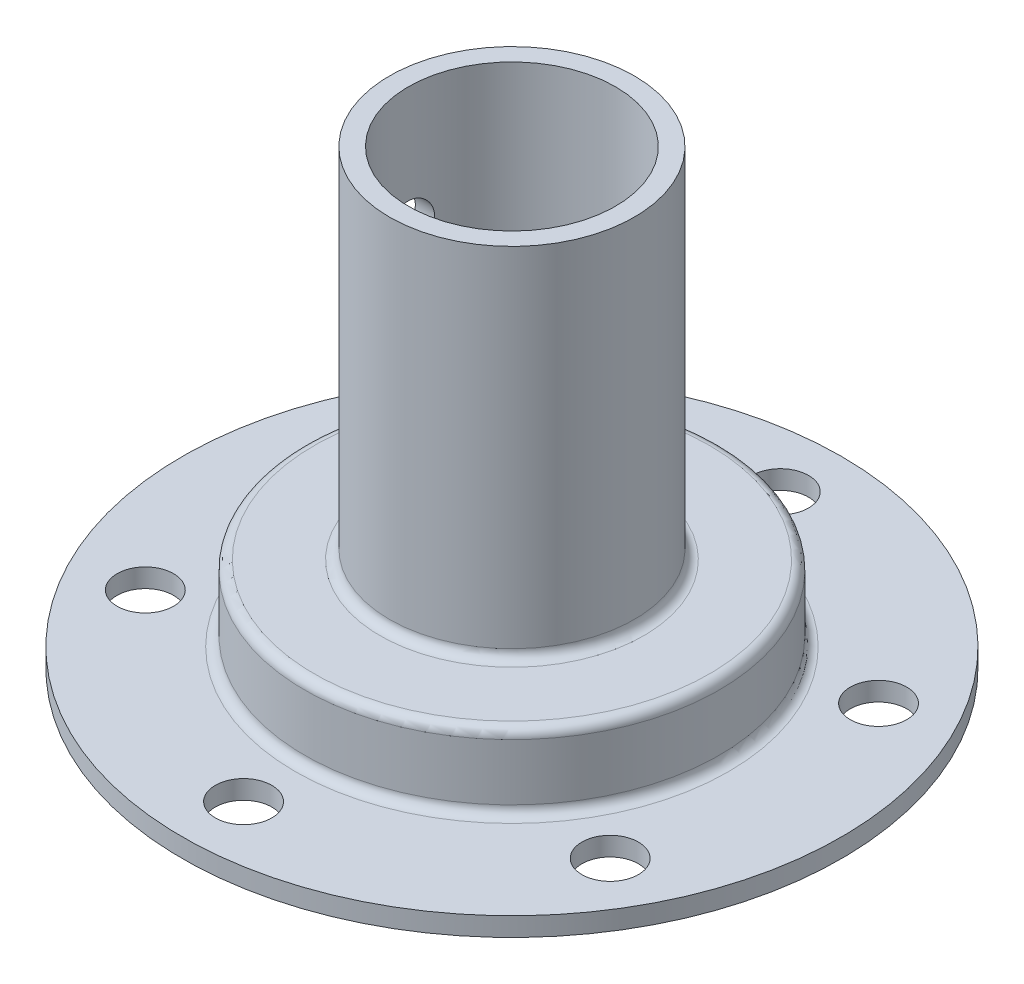
ISO-10303-21;
HEADER;
FILE_DESCRIPTION(('STEP AP214'),'2;1');
FILE_NAME('part.step','',(''),(''),'','','');
FILE_SCHEMA(('AUTOMOTIVE_DESIGN { 1 0 10303 214 1 1 1 1 }'));
ENDSEC;
DATA;
#1=APPLICATION_CONTEXT('core data for automotive mechanical design processes');
#2=APPLICATION_PROTOCOL_DEFINITION('international standard','automotive_design',2000,#1);
#3=PRODUCT_CONTEXT('',#1,'mechanical');
#4=PRODUCT('Part','Part','',(#3));
#5=PRODUCT_RELATED_PRODUCT_CATEGORY('part','',(#4));
#6=PRODUCT_DEFINITION_FORMATION('','',#4);
#7=PRODUCT_DEFINITION_CONTEXT('part definition',#1,'design');
#8=PRODUCT_DEFINITION('design','',#6,#7);
#9=PRODUCT_DEFINITION_SHAPE('','',#8);
#10=(LENGTH_UNIT() NAMED_UNIT(*) SI_UNIT(.MILLI.,.METRE.));
#11=(NAMED_UNIT(*) PLANE_ANGLE_UNIT() SI_UNIT($,.RADIAN.));
#12=(NAMED_UNIT(*) SI_UNIT($,.STERADIAN.) SOLID_ANGLE_UNIT());
#13=UNCERTAINTY_MEASURE_WITH_UNIT(LENGTH_MEASURE(1.E-05),#10,'distance_accuracy_value','');
#14=(GEOMETRIC_REPRESENTATION_CONTEXT(3) GLOBAL_UNCERTAINTY_ASSIGNED_CONTEXT((#13)) GLOBAL_UNIT_ASSIGNED_CONTEXT((#10,
#11,#12)) REPRESENTATION_CONTEXT('',''));
#15=CARTESIAN_POINT('',(0.,0.,0.));
#16=DIRECTION('',(0.,0.,1.));
#17=DIRECTION('',(1.,0.,0.));
#18=AXIS2_PLACEMENT_3D('',#15,#16,#17);
#19=CARTESIAN_POINT('',(0.,0.,0.));
#20=DIRECTION('',(0.,-1.,0.));
#21=DIRECTION('',(0.,0.,-1.));
#22=AXIS2_PLACEMENT_3D('',#19,#20,#21);
#23=CYLINDRICAL_SURFACE('',#22,20.);
#24=CARTESIAN_POINT('',(0.,0.,0.));
#25=DIRECTION('',(0.,-1.,0.));
#26=DIRECTION('',(0.,0.,-1.));
#27=AXIS2_PLACEMENT_3D('',#24,#25,#26);
#28=CIRCLE('',#27,20.);
#29=CARTESIAN_POINT('',(0.,0.,-20.));
#30=VERTEX_POINT('',#29);
#31=EDGE_CURVE('E82',#30,#30,#28,.T.);
#32=ORIENTED_EDGE('',*,*,#31,.T.);
#33=EDGE_LOOP('',(#32));
#34=FACE_BOUND('',#33,.T.);
#35=CARTESIAN_POINT('',(0.,6.99999999999999,0.));
#36=DIRECTION('',(0.,-1.,0.));
#37=DIRECTION('',(0.,0.,-1.));
#38=AXIS2_PLACEMENT_3D('',#35,#36,#37);
#39=CIRCLE('',#38,20.);
#40=CARTESIAN_POINT('',(0.,6.99999999999999,-20.));
#41=VERTEX_POINT('',#40);
#42=EDGE_CURVE('E10',#41,#41,#39,.T.);
#43=ORIENTED_EDGE('',*,*,#42,.F.);
#44=EDGE_LOOP('',(#43));
#45=FACE_BOUND('',#44,.T.);
#46=ADVANCED_FACE('F32',(#34,#45),#23,.F.);
#47=CARTESIAN_POINT('',(0.,7.,0.));
#48=DIRECTION('',(0.,-1.,0.));
#49=DIRECTION('',(0.,0.,-1.));
#50=AXIS2_PLACEMENT_3D('',#47,#48,#49);
#51=TOROIDAL_SURFACE('',#50,19.,1.);
#52=ORIENTED_EDGE('',*,*,#42,.T.);
#53=EDGE_LOOP('',(#52));
#54=FACE_BOUND('',#53,.T.);
#55=CARTESIAN_POINT('',(0.,8.,0.));
#56=DIRECTION('',(0.,-1.,0.));
#57=DIRECTION('',(0.,0.,-1.));
#58=AXIS2_PLACEMENT_3D('',#55,#56,#57);
#59=CIRCLE('',#58,19.);
#60=CARTESIAN_POINT('',(0.,8.,-19.));
#61=VERTEX_POINT('',#60);
#62=EDGE_CURVE('E43',#61,#61,#59,.T.);
#63=ORIENTED_EDGE('',*,*,#62,.F.);
#64=EDGE_LOOP('',(#63));
#65=FACE_BOUND('',#64,.T.);
#66=ADVANCED_FACE('F205',(#54,#65),#51,.F.);
#67=CARTESIAN_POINT('',(11.,8.,0.));
#68=DIRECTION('',(0.,-1.,0.));
#69=DIRECTION('',(0.,0.,-1.));
#70=AXIS2_PLACEMENT_3D('',#67,#68,#69);
#71=PLANE('',#70);
#72=ORIENTED_EDGE('',*,*,#62,.T.);
#73=EDGE_LOOP('',(#72));
#74=FACE_BOUND('',#73,.T.);
#75=CARTESIAN_POINT('',(0.,8.,0.));
#76=DIRECTION('',(0.,-1.,0.));
#77=DIRECTION('',(0.,0.,-1.));
#78=AXIS2_PLACEMENT_3D('',#75,#76,#77);
#79=CIRCLE('',#78,11.);
#80=CARTESIAN_POINT('',(0.,8.,-11.));
#81=VERTEX_POINT('',#80);
#82=EDGE_CURVE('E47',#81,#81,#79,.T.);
#83=ORIENTED_EDGE('',*,*,#82,.F.);
#84=EDGE_LOOP('',(#83));
#85=FACE_BOUND('',#84,.T.);
#86=ADVANCED_FACE('F201',(#74,#85),#71,.T.);
#87=CARTESIAN_POINT('',(0.,0.,0.));
#88=DIRECTION('',(0.,-1.,0.));
#89=DIRECTION('',(0.,0.,-1.));
#90=AXIS2_PLACEMENT_3D('',#87,#88,#89);
#91=CYLINDRICAL_SURFACE('',#90,11.);
#92=CARTESIAN_POINT('',(-10.7121426428143,35.,-2.5));
#93=CARTESIAN_POINT('',(-10.7121454314233,35.1384661909545,-2.49999543238962));
#94=CARTESIAN_POINT('',(-10.7148566472694,35.2769860823372,-2.48845712333954));
#95=CARTESIAN_POINT('',(-10.7253866484904,35.5500765750563,-2.44266520236751));
#96=CARTESIAN_POINT('',(-10.7332089369474,35.6846444015345,-2.40839601066357));
#97=CARTESIAN_POINT('',(-10.7530304465066,35.9458410583735,-2.31828540377217));
#98=CARTESIAN_POINT('',(-10.7650248735991,36.072478804585,-2.26246873972878));
#99=CARTESIAN_POINT('',(-10.7918333757398,36.3145983996813,-2.13091974990438));
#100=CARTESIAN_POINT('',(-10.8066474399211,36.4300802915581,-2.05518750087741));
#101=CARTESIAN_POINT('',(-10.8377278041731,36.6487154808709,-1.88448528035886));
#102=CARTESIAN_POINT('',(-10.8540139214629,36.7516357804105,-1.78922044020225));
#103=CARTESIAN_POINT('',(-10.8860302886159,36.9401825051092,-1.58279346057436));
#104=CARTESIAN_POINT('',(-10.9017604930117,37.0258075183944,-1.4716300245101));
#105=CARTESIAN_POINT('',(-10.93110941005,37.1782630482721,-1.23499021284435));
#106=CARTESIAN_POINT('',(-10.9447020098483,37.2448682004307,-1.10936512825884));
#107=CARTESIAN_POINT('',(-10.9680197641523,37.3559334184131,-0.848343855636443));
#108=CARTESIAN_POINT('',(-10.9777453878714,37.4003961711304,-0.712948855424523));
#109=CARTESIAN_POINT('',(-10.992093320832,37.4651780957488,-0.438655593897398));
#110=CARTESIAN_POINT('',(-10.9967989680676,37.4858919773575,-0.299854987503797));
#111=CARTESIAN_POINT('',(-11.0008659279287,37.5038235330812,-0.0206744590410423));
#112=CARTESIAN_POINT('',(-11.0002278985982,37.5010441002659,0.119705266442305));
#113=CARTESIAN_POINT('',(-10.9937426547597,37.4723592714265,0.395333870912043));
#114=CARTESIAN_POINT('',(-10.9879913110538,37.4468794719863,0.53062963162453));
#115=CARTESIAN_POINT('',(-10.972035500945,37.3741969203486,0.794973031158361));
#116=CARTESIAN_POINT('',(-10.9618308229987,37.3269931362067,0.92402037284203));
#117=CARTESIAN_POINT('',(-10.9379627182996,37.2118345901329,1.17336944375684));
#118=CARTESIAN_POINT('',(-10.9242729764965,37.1437210992642,1.29359524399307));
#119=CARTESIAN_POINT('',(-10.8949317146097,36.9887954880441,1.52106399956616));
#120=CARTESIAN_POINT('',(-10.8792799076932,36.901980632418,1.62830505215689));
#121=CARTESIAN_POINT('',(-10.8473171066438,36.7098085843367,1.82929354427355));
#122=CARTESIAN_POINT('',(-10.8309992019581,36.6040789891996,1.92268414978478));
#123=CARTESIAN_POINT('',(-10.7998704044976,36.3782891842626,2.09047920073133));
#124=CARTESIAN_POINT('',(-10.7850595594488,36.2582285208849,2.16488304500243));
#125=CARTESIAN_POINT('',(-10.7586016791364,36.0065760118903,2.29276887377835));
#126=CARTESIAN_POINT('',(-10.7469656031437,35.8749462460802,2.3461786596901));
#127=CARTESIAN_POINT('',(-10.7283231226734,35.6042514462607,2.43000958929392));
#128=CARTESIAN_POINT('',(-10.7213159185924,35.4651877009047,2.46043470354816));
#129=CARTESIAN_POINT('',(-10.7128889420635,35.1868457523382,2.49686920193376));
#130=CARTESIAN_POINT('',(-10.7113498101725,35.0476393671863,2.50340025202095));
#131=CARTESIAN_POINT('',(-10.7137104989267,34.7701267918547,2.49327772715817));
#132=CARTESIAN_POINT('',(-10.7176099135701,34.6318205352524,2.47662588287242));
#133=CARTESIAN_POINT('',(-10.7302951733771,34.3618817061916,2.42106417661717));
#134=CARTESIAN_POINT('',(-10.7390169712549,34.2301858331942,2.38244586746638));
#135=CARTESIAN_POINT('',(-10.7603057031402,33.9751344075693,2.28436509536444));
#136=CARTESIAN_POINT('',(-10.7728730289421,33.8517797063308,2.22490050843923));
#137=CARTESIAN_POINT('',(-10.8006961734274,33.6146669609607,2.08568096094999));
#138=CARTESIAN_POINT('',(-10.8159929667106,33.5011010609591,2.00560710889277));
#139=CARTESIAN_POINT('',(-10.847445444588,33.288826696754,1.82785558175615));
#140=CARTESIAN_POINT('',(-10.8636012445728,33.1901202354813,1.73017553739798));
#141=CARTESIAN_POINT('',(-10.8953477425749,33.0083189019842,1.51761489811829));
#142=CARTESIAN_POINT('',(-10.9109203453324,32.9255810752792,1.40242575322726));
#143=CARTESIAN_POINT('',(-10.9394030007809,32.780629185695,1.15948167628699));
#144=CARTESIAN_POINT('',(-10.9523131827213,32.7184141264344,1.03172735466866));
#145=CARTESIAN_POINT('',(-10.9739405859898,32.61675958892,0.768105049315913));
#146=CARTESIAN_POINT('',(-10.9826854368624,32.5771696726011,0.632297446270904));
#147=CARTESIAN_POINT('',(-10.9951167589318,32.5214234526457,0.35573628308248));
#148=CARTESIAN_POINT('',(-10.9988040274401,32.5052634553357,0.214983506118728));
#149=CARTESIAN_POINT('',(-11.0006787302882,32.4970128838281,-0.0640926427285445));
#150=CARTESIAN_POINT('',(-10.9989875888252,32.504390921494,-0.202399752438723));
#151=CARTESIAN_POINT('',(-10.9905580161125,32.5418109486781,-0.47574778972938));
#152=CARTESIAN_POINT('',(-10.9838196900264,32.571852465978,-0.610788785302398));
#153=CARTESIAN_POINT('',(-10.96606448264,32.6534836392113,-0.873322034218739));
#154=CARTESIAN_POINT('',(-10.9550636655368,32.7049924451014,-1.00084058283969));
#155=CARTESIAN_POINT('',(-10.9299536917879,32.8280192268602,-1.24549315867952));
#156=CARTESIAN_POINT('',(-10.9158442081789,32.8995393076878,-1.36262609174177));
#157=CARTESIAN_POINT('',(-10.8856935133435,33.0622619646428,-1.58575630284182));
#158=CARTESIAN_POINT('',(-10.8696188788032,33.1538349143972,-1.69147898146279));
#159=CARTESIAN_POINT('',(-10.8375213996161,33.3533239702978,-1.88623829979112));
#160=CARTESIAN_POINT('',(-10.8214985685478,33.461244054585,-1.97527086605942));
#161=CARTESIAN_POINT('',(-10.7910549272231,33.6922719938169,-2.13539007203786));
#162=CARTESIAN_POINT('',(-10.7766611159887,33.8155797128554,-2.2061937971019));
#163=CARTESIAN_POINT('',(-10.7514502387736,34.072648851257,-2.32596037579883));
#164=CARTESIAN_POINT('',(-10.7406302556445,34.2064016339802,-2.37494105401434));
#165=CARTESIAN_POINT('',(-10.72571344068,34.45016795747,-2.44129910462464));
#166=CARTESIAN_POINT('',(-10.7206593017667,34.5588961725737,-2.46326828297558));
#167=CARTESIAN_POINT('',(-10.7138728814852,34.7784048718095,-2.49262014337059));
#168=CARTESIAN_POINT('',(-10.712140411085,34.8891852387938,-2.50000365546745));
#169=CARTESIAN_POINT('',(-10.7121426428143,35.,-2.5));
#170=B_SPLINE_CURVE_WITH_KNOTS('',3,(#92,#93,#94,#95,#96,#97,#98,#99,#100,#101,#102,#103,#104,
#105,#106,#107,#108,#109,#110,#111,#112,#113,#114,#115,#116,#117,#118,#119,#120,#121,#122,#123,
#124,#125,#126,#127,#128,#129,#130,#131,#132,#133,#134,#135,#136,#137,#138,#139,#140,#141,#142,
#143,#144,#145,#146,#147,#148,#149,#150,#151,#152,#153,#154,#155,#156,#157,#158,#159,#160,#161,
#162,#163,#164,#165,#166,#167,#168,#169),.UNSPECIFIED.,.T.,.F.,(4,2,2,2,2,2,2,2,2,2,2,2,2,2,2,2,
2,2,2,2,2,2,2,2,2,2,2,2,2,2,2,2,2,2,2,2,2,2,4),(0.,0.414992243301633,0.830269217244779,
1.2450705835768,1.65987035130106,2.08146637272044,2.5030967965796,2.92953338750108,
3.35591821939513,3.77510878183785,4.19424772406961,4.60569006667321,5.01715195585207,
5.43181796836808,5.84654467145159,6.27057865094874,6.69462605466424,7.12011925968862,
7.5455389446812,7.96161330230365,8.37765660054312,8.78830262277904,9.19899049685669,
9.6164612095842,10.0339881436657,10.4599792598124,10.8859496910277,11.3090538013157,
11.7320912029453,12.1456463784943,12.5591929374091,12.9711958750873,13.3832421670976,
13.8036601623803,14.2241806329332,14.6508801056332,15.0772304178392,15.4093684172414,
15.7414875145233),.UNSPECIFIED.);
#171=CARTESIAN_POINT('',(-10.7121426428143,35.,-2.5));
#172=VERTEX_POINT('',#171);
#173=EDGE_CURVE('E119',#172,#172,#170,.T.);
#174=ORIENTED_EDGE('',*,*,#173,.F.);
#175=EDGE_LOOP('',(#174));
#176=FACE_BOUND('',#175,.T.);
#177=ORIENTED_EDGE('',*,*,#82,.T.);
#178=EDGE_LOOP('',(#177));
#179=FACE_BOUND('',#178,.T.);
#180=CARTESIAN_POINT('',(0.,48.,0.));
#181=DIRECTION('',(0.,-1.,0.));
#182=DIRECTION('',(0.,0.,-1.));
#183=AXIS2_PLACEMENT_3D('',#180,#181,#182);
#184=CIRCLE('',#183,11.);
#185=CARTESIAN_POINT('',(0.,48.,-11.));
#186=VERTEX_POINT('',#185);
#187=EDGE_CURVE('E52',#186,#186,#184,.T.);
#188=ORIENTED_EDGE('',*,*,#187,.F.);
#189=EDGE_LOOP('',(#188));
#190=FACE_BOUND('',#189,.T.);
#191=ADVANCED_FACE('F126',(#176,#179,#190),#91,.F.);
#192=CARTESIAN_POINT('',(13.,48.,0.));
#193=DIRECTION('',(0.,1.,0.));
#194=DIRECTION('',(0.,0.,1.));
#195=AXIS2_PLACEMENT_3D('',#192,#193,#194);
#196=PLANE('',#195);
#197=ORIENTED_EDGE('',*,*,#187,.T.);
#198=EDGE_LOOP('',(#197));
#199=FACE_BOUND('',#198,.T.);
#200=CARTESIAN_POINT('',(0.,48.,0.));
#201=DIRECTION('',(0.,-1.,0.));
#202=DIRECTION('',(0.,0.,-1.));
#203=AXIS2_PLACEMENT_3D('',#200,#201,#202);
#204=CIRCLE('',#203,13.);
#205=CARTESIAN_POINT('',(0.,48.,-13.));
#206=VERTEX_POINT('',#205);
#207=EDGE_CURVE('E55',#206,#206,#204,.T.);
#208=ORIENTED_EDGE('',*,*,#207,.F.);
#209=EDGE_LOOP('',(#208));
#210=FACE_BOUND('',#209,.T.);
#211=ADVANCED_FACE('F194',(#199,#210),#196,.T.);
#212=CARTESIAN_POINT('',(0.,0.,0.));
#213=DIRECTION('',(0.,-1.,0.));
#214=DIRECTION('',(0.,0.,-1.));
#215=AXIS2_PLACEMENT_3D('',#212,#213,#214);
#216=CYLINDRICAL_SURFACE('',#215,13.);
#217=CARTESIAN_POINT('',(-12.7573508221731,35.,-2.5));
#218=CARTESIAN_POINT('',(-12.7573535445971,34.8609741402386,-2.49999473771111));
#219=CARTESIAN_POINT('',(-12.759648106677,34.7218807698169,-2.48836372459743));
#220=CARTESIAN_POINT('',(-12.7685662321878,34.4476209411147,-2.44218113719486));
#221=CARTESIAN_POINT('',(-12.7751933891363,34.3124578399415,-2.40761053611891));
#222=CARTESIAN_POINT('',(-12.7919990068767,34.0500663552577,-2.31665374663639));
#223=CARTESIAN_POINT('',(-12.8021740742201,33.9228305261755,-2.26028839852832));
#224=CARTESIAN_POINT('',(-12.8249250156472,33.6796274500609,-2.12739803553042));
#225=CARTESIAN_POINT('',(-12.8375007225812,33.5636594193318,-2.05087442406184));
#226=CARTESIAN_POINT('',(-12.8638197867113,33.3447587875637,-1.8787724582243));
#227=CARTESIAN_POINT('',(-12.8775751102276,33.2419950504917,-1.78298111863696));
#228=CARTESIAN_POINT('',(-12.9045979802699,33.0538924698524,-1.5755231225806));
#229=CARTESIAN_POINT('',(-12.9178654939172,32.9685547990555,-1.46385539849172));
#230=CARTESIAN_POINT('',(-12.9425463769484,32.8170765897423,-1.22670187107625));
#231=CARTESIAN_POINT('',(-12.9539439985905,32.751095741295,-1.10111228887017));
#232=CARTESIAN_POINT('',(-12.9734667695503,32.6412335746728,-0.840374478610752));
#233=CARTESIAN_POINT('',(-12.9815922019259,32.5973503448802,-0.705227078537795));
#234=CARTESIAN_POINT('',(-12.9935705508999,32.5334525964944,-0.430960845173449));
#235=CARTESIAN_POINT('',(-12.9974744160998,32.5131532248799,-0.291910638125102));
#236=CARTESIAN_POINT('',(-13.0007455117712,32.4961114167779,-0.0123270709409606));
#237=CARTESIAN_POINT('',(-13.000113147748,32.499366874664,0.128206155502511));
#238=CARTESIAN_POINT('',(-12.9944227232997,32.5291247626059,0.404811580289862));
#239=CARTESIAN_POINT('',(-12.9894230651197,32.5553204331309,0.540918156089662));
#240=CARTESIAN_POINT('',(-12.9756254537905,32.6297294543125,0.806767049653703));
#241=CARTESIAN_POINT('',(-12.9668273569848,32.6779436377117,0.936509126506348));
#242=CARTESIAN_POINT('',(-12.9463243258099,32.7953102821441,1.18683036724386));
#243=CARTESIAN_POINT('',(-12.9346025687447,32.864584445285,1.30735103519341));
#244=CARTESIAN_POINT('',(-12.9095469786328,33.0220147939395,1.53517146817959));
#245=CARTESIAN_POINT('',(-12.8962129735448,33.1101729953257,1.64246981980512));
#246=CARTESIAN_POINT('',(-12.8691545349335,33.3045565091686,1.84261846944045));
#247=CARTESIAN_POINT('',(-12.855427272809,33.411050234235,1.93520788986346));
#248=CARTESIAN_POINT('',(-12.8293343997587,33.6381901746724,2.10125316353159));
#249=CARTESIAN_POINT('',(-12.8169688108631,33.7588366189529,2.17470870723888));
#250=CARTESIAN_POINT('',(-12.7949946866483,34.0112140172712,2.30048133251874));
#251=CARTESIAN_POINT('',(-12.785391318016,34.1429651551236,2.35275887460558));
#252=CARTESIAN_POINT('',(-12.7701067672006,34.4136075543789,2.43436110074129));
#253=CARTESIAN_POINT('',(-12.7644251156011,34.5524979590964,2.4636885318979));
#254=CARTESIAN_POINT('',(-12.7577206137951,34.8311193246285,2.49817375220936));
#255=CARTESIAN_POINT('',(-12.7566253860666,34.9708021136838,2.50370706985663));
#256=CARTESIAN_POINT('',(-12.7590238308419,35.2490953638697,2.49145509963842));
#257=CARTESIAN_POINT('',(-12.7625172639236,35.3877058805686,2.4736710284025));
#258=CARTESIAN_POINT('',(-12.7736318530023,35.6586749431925,2.41561200598846));
#259=CARTESIAN_POINT('',(-12.7812165991315,35.7910776041667,2.37553534674614));
#260=CARTESIAN_POINT('',(-12.7996276252393,36.0472888474545,2.27423978654129));
#261=CARTESIAN_POINT('',(-12.8104541548475,36.1710967670358,2.21301925736502));
#262=CARTESIAN_POINT('',(-12.8342928537119,36.408254242385,2.07031485911768));
#263=CARTESIAN_POINT('',(-12.8473298999345,36.5214590144377,1.98859461228271));
#264=CARTESIAN_POINT('',(-12.8740513624295,36.732685118866,1.80752787788233));
#265=CARTESIAN_POINT('',(-12.8877358399847,36.8307050101472,1.70817971928818));
#266=CARTESIAN_POINT('',(-12.9144437282901,37.0101897520335,1.49299681253014));
#267=CARTESIAN_POINT('',(-12.9274550888692,37.0914015320574,1.37694924353664));
#268=CARTESIAN_POINT('',(-12.951145430407,37.2331753060949,1.13263940226607));
#269=CARTESIAN_POINT('',(-12.9618245043496,37.2937381233967,1.00437761723896));
#270=CARTESIAN_POINT('',(-12.9795953468859,37.3921197298356,0.739966613700503));
#271=CARTESIAN_POINT('',(-12.9867063704086,37.4300608106462,0.603864248412592));
#272=CARTESIAN_POINT('',(-12.9966222021743,37.4825111946202,0.327068775042131));
#273=CARTESIAN_POINT('',(-12.9994274881639,37.4970230973968,0.186376178041923));
#274=CARTESIAN_POINT('',(-13.0004055871504,37.5021088314925,-0.0931827521181713));
#275=CARTESIAN_POINT('',(-12.9986522399737,37.4930642223302,-0.23204202862034));
#276=CARTESIAN_POINT('',(-12.9908642019523,37.4521319198343,-0.506222907249131));
#277=CARTESIAN_POINT('',(-12.9848295568325,37.4202444704656,-0.641544547142221));
#278=CARTESIAN_POINT('',(-12.9691577474469,37.3346958076119,-0.904593549254303));
#279=CARTESIAN_POINT('',(-12.9595276339264,37.2810771916485,-1.03233521137864));
#280=CARTESIAN_POINT('',(-12.9377052532993,37.1536348854929,-1.2770648824587));
#281=CARTESIAN_POINT('',(-12.9255128027328,37.0798097484262,-1.39405212054941));
#282=CARTESIAN_POINT('',(-12.8996784805017,36.9127465496702,-1.61584795767645));
#283=CARTESIAN_POINT('',(-12.8860176059801,36.8192338279224,-1.72044748489624));
#284=CARTESIAN_POINT('',(-12.8589033276349,36.6160178174388,-1.91260166612257));
#285=CARTESIAN_POINT('',(-12.8454499734772,36.5063107173201,-2.00015229635294));
#286=CARTESIAN_POINT('',(-12.8201292259648,36.2725301610452,-2.15653452422156));
#287=CARTESIAN_POINT('',(-12.8082786988589,36.148326241084,-2.22517391596927));
#288=CARTESIAN_POINT('',(-12.7877094152025,35.8899592262486,-2.340501544276));
#289=CARTESIAN_POINT('',(-12.7789877475578,35.7558055296597,-2.3872101977801));
#290=CARTESIAN_POINT('',(-12.7674530961672,35.5177416252547,-2.4480213622143));
#291=CARTESIAN_POINT('',(-12.7636876084207,35.4152120123956,-2.46747939479382));
#292=CARTESIAN_POINT('',(-12.7586354876446,35.2084675536626,-2.49347049397996));
#293=CARTESIAN_POINT('',(-12.7573487806808,35.1042527581459,-2.50000394608695));
#294=CARTESIAN_POINT('',(-12.7573508221731,35.,-2.5));
#295=B_SPLINE_CURVE_WITH_KNOTS('',3,(#217,#218,#219,#220,#221,#222,#223,#224,#225,#226,#227,
#228,#229,#230,#231,#232,#233,#234,#235,#236,#237,#238,#239,#240,#241,#242,#243,#244,#245,#246,
#247,#248,#249,#250,#251,#252,#253,#254,#255,#256,#257,#258,#259,#260,#261,#262,#263,#264,#265,
#266,#267,#268,#269,#270,#271,#272,#273,#274,#275,#276,#277,#278,#279,#280,#281,#282,#283,#284,
#285,#286,#287,#288,#289,#290,#291,#292,#293,#294),.UNSPECIFIED.,.T.,.F.,(4,2,2,2,2,2,2,2,2,2,2,
2,2,2,2,2,2,2,2,2,2,2,2,2,2,2,2,2,2,2,2,2,2,2,2,2,2,2,4),(0.,0.416695988880008,0.83373803073764,
1.25038227614467,1.66699752238094,2.08849971831381,2.5100302719089,2.93494642182602,
3.35982580683554,3.77951819081206,4.19917305788035,4.61330049028081,5.02744358632398,
5.44402696725574,5.86065484067581,6.2840009193815,6.70735384633276,7.13149357344848,
7.55558252364952,7.97295317898354,8.39030205806815,8.80399666093121,9.21772312804067,
9.63645909210583,10.0552347712562,10.4799185943274,10.9045854829869,11.32693532976,
11.7492383109661,12.1647436860036,12.5802446234503,12.9949350033565,13.4096550846627,
13.8305978202814,14.251639784134,14.6768151908599,15.1015939816585,15.4140754294552,
15.7265475567532),.UNSPECIFIED.);
#296=CARTESIAN_POINT('',(-12.7573508221731,35.,-2.5));
#297=VERTEX_POINT('',#296);
#298=EDGE_CURVE('E35',#297,#297,#295,.T.);
#299=ORIENTED_EDGE('',*,*,#298,.F.);
#300=EDGE_LOOP('',(#299));
#301=FACE_BOUND('',#300,.T.);
#302=ORIENTED_EDGE('',*,*,#207,.T.);
#303=EDGE_LOOP('',(#302));
#304=FACE_BOUND('',#303,.T.);
#305=CARTESIAN_POINT('',(0.,11.,0.));
#306=DIRECTION('',(0.,-1.,0.));
#307=DIRECTION('',(0.,0.,-1.));
#308=AXIS2_PLACEMENT_3D('',#305,#306,#307);
#309=CIRCLE('',#308,13.);
#310=CARTESIAN_POINT('',(0.,11.,-13.));
#311=VERTEX_POINT('',#310);
#312=EDGE_CURVE('E58',#311,#311,#309,.T.);
#313=ORIENTED_EDGE('',*,*,#312,.F.);
#314=EDGE_LOOP('',(#313));
#315=FACE_BOUND('',#314,.T.);
#316=ADVANCED_FACE('F190',(#301,#304,#315),#216,.T.);
#317=CARTESIAN_POINT('',(0.,11.,0.));
#318=DIRECTION('',(0.,-1.,0.));
#319=DIRECTION('',(0.,0.,-1.));
#320=AXIS2_PLACEMENT_3D('',#317,#318,#319);
#321=TOROIDAL_SURFACE('',#320,14.,1.);
#322=ORIENTED_EDGE('',*,*,#312,.T.);
#323=EDGE_LOOP('',(#322));
#324=FACE_BOUND('',#323,.T.);
#325=CARTESIAN_POINT('',(0.,10.,0.));
#326=DIRECTION('',(0.,-1.,0.));
#327=DIRECTION('',(0.,0.,-1.));
#328=AXIS2_PLACEMENT_3D('',#325,#326,#327);
#329=CIRCLE('',#328,14.);
#330=CARTESIAN_POINT('',(0.,10.,-14.));
#331=VERTEX_POINT('',#330);
#332=EDGE_CURVE('E61',#331,#331,#329,.T.);
#333=ORIENTED_EDGE('',*,*,#332,.F.);
#334=EDGE_LOOP('',(#333));
#335=FACE_BOUND('',#334,.T.);
#336=ADVANCED_FACE('F187',(#324,#335),#321,.F.);
#337=CARTESIAN_POINT('',(21.,10.,0.));
#338=DIRECTION('',(0.,1.,0.));
#339=DIRECTION('',(0.,0.,1.));
#340=AXIS2_PLACEMENT_3D('',#337,#338,#339);
#341=PLANE('',#340);
#342=ORIENTED_EDGE('',*,*,#332,.T.);
#343=EDGE_LOOP('',(#342));
#344=FACE_BOUND('',#343,.T.);
#345=CARTESIAN_POINT('',(0.,10.,0.));
#346=DIRECTION('',(0.,-1.,0.));
#347=DIRECTION('',(0.,0.,-1.));
#348=AXIS2_PLACEMENT_3D('',#345,#346,#347);
#349=CIRCLE('',#348,21.);
#350=CARTESIAN_POINT('',(0.,10.,-21.));
#351=VERTEX_POINT('',#350);
#352=EDGE_CURVE('E64',#351,#351,#349,.T.);
#353=ORIENTED_EDGE('',*,*,#352,.F.);
#354=EDGE_LOOP('',(#353));
#355=FACE_BOUND('',#354,.T.);
#356=ADVANCED_FACE('F183',(#344,#355),#341,.T.);
#357=CARTESIAN_POINT('',(0.,9.,0.));
#358=DIRECTION('',(0.,-1.,0.));
#359=DIRECTION('',(0.,0.,-1.));
#360=AXIS2_PLACEMENT_3D('',#357,#358,#359);
#361=TOROIDAL_SURFACE('',#360,21.,1.);
#362=ORIENTED_EDGE('',*,*,#352,.T.);
#363=EDGE_LOOP('',(#362));
#364=FACE_BOUND('',#363,.T.);
#365=CARTESIAN_POINT('',(0.,8.99999999999999,0.));
#366=DIRECTION('',(0.,-1.,0.));
#367=DIRECTION('',(0.,0.,-1.));
#368=AXIS2_PLACEMENT_3D('',#365,#366,#367);
#369=CIRCLE('',#368,22.);
#370=CARTESIAN_POINT('',(0.,8.99999999999999,-22.));
#371=VERTEX_POINT('',#370);
#372=EDGE_CURVE('E67',#371,#371,#369,.T.);
#373=ORIENTED_EDGE('',*,*,#372,.F.);
#374=EDGE_LOOP('',(#373));
#375=FACE_BOUND('',#374,.T.);
#376=ADVANCED_FACE('F179',(#364,#375),#361,.T.);
#377=CARTESIAN_POINT('',(0.,0.,0.));
#378=DIRECTION('',(0.,-1.,0.));
#379=DIRECTION('',(0.,0.,-1.));
#380=AXIS2_PLACEMENT_3D('',#377,#378,#379);
#381=CYLINDRICAL_SURFACE('',#380,22.);
#382=ORIENTED_EDGE('',*,*,#372,.T.);
#383=EDGE_LOOP('',(#382));
#384=FACE_BOUND('',#383,.T.);
#385=CARTESIAN_POINT('',(0.,3.00000000000001,0.));
#386=DIRECTION('',(0.,-1.,0.));
#387=DIRECTION('',(0.,0.,-1.));
#388=AXIS2_PLACEMENT_3D('',#385,#386,#387);
#389=CIRCLE('',#388,22.);
#390=CARTESIAN_POINT('',(0.,3.00000000000001,-22.));
#391=VERTEX_POINT('',#390);
#392=EDGE_CURVE('E70',#391,#391,#389,.T.);
#393=ORIENTED_EDGE('',*,*,#392,.F.);
#394=EDGE_LOOP('',(#393));
#395=FACE_BOUND('',#394,.T.);
#396=ADVANCED_FACE('F175',(#384,#395),#381,.T.);
#397=CARTESIAN_POINT('',(0.,3.,0.));
#398=DIRECTION('',(0.,-1.,0.));
#399=DIRECTION('',(0.,0.,-1.));
#400=AXIS2_PLACEMENT_3D('',#397,#398,#399);
#401=TOROIDAL_SURFACE('',#400,23.,1.);
#402=ORIENTED_EDGE('',*,*,#392,.T.);
#403=EDGE_LOOP('',(#402));
#404=FACE_BOUND('',#403,.T.);
#405=CARTESIAN_POINT('',(0.,2.,0.));
#406=DIRECTION('',(0.,-1.,0.));
#407=DIRECTION('',(0.,0.,-1.));
#408=AXIS2_PLACEMENT_3D('',#405,#406,#407);
#409=CIRCLE('',#408,23.);
#410=CARTESIAN_POINT('',(0.,2.,-23.));
#411=VERTEX_POINT('',#410);
#412=EDGE_CURVE('E73',#411,#411,#409,.T.);
#413=ORIENTED_EDGE('',*,*,#412,.F.);
#414=EDGE_LOOP('',(#413));
#415=FACE_BOUND('',#414,.T.);
#416=ADVANCED_FACE('F171',(#404,#415),#401,.F.);
#417=CARTESIAN_POINT('',(35.,2.,0.));
#418=DIRECTION('',(0.,1.,0.));
#419=DIRECTION('',(0.,0.,1.));
#420=AXIS2_PLACEMENT_3D('',#417,#418,#419);
#421=PLANE('',#420);
#422=CARTESIAN_POINT('',(-24.6817240078553,2.,-14.249999999998));
#423=DIRECTION('',(0.,1.,0.));
#424=DIRECTION('',(0.,0.,1.));
#425=AXIS2_PLACEMENT_3D('',#422,#423,#424);
#426=CIRCLE('',#425,3.);
#427=CARTESIAN_POINT('',(-24.6817240078553,2.,-11.249999999998));
#428=VERTEX_POINT('',#427);
#429=EDGE_CURVE('E116',#428,#428,#426,.T.);
#430=ORIENTED_EDGE('',*,*,#429,.F.);
#431=EDGE_LOOP('',(#430));
#432=FACE_BOUND('',#431,.T.);
#433=CARTESIAN_POINT('',(-24.681724007853,2.,14.250000000002));
#434=DIRECTION('',(0.,1.,0.));
#435=DIRECTION('',(0.,0.,1.));
#436=AXIS2_PLACEMENT_3D('',#433,#434,#435);
#437=CIRCLE('',#436,3.);
#438=CARTESIAN_POINT('',(-24.681724007853,2.,17.250000000002));
#439=VERTEX_POINT('',#438);
#440=EDGE_CURVE('E110',#439,#439,#437,.T.);
#441=ORIENTED_EDGE('',*,*,#440,.F.);
#442=EDGE_LOOP('',(#441));
#443=FACE_BOUND('',#442,.T.);
#444=CARTESIAN_POINT('',(4.6728656272083E-12,2.,28.5));
#445=DIRECTION('',(0.,1.,0.));
#446=DIRECTION('',(0.,0.,1.));
#447=AXIS2_PLACEMENT_3D('',#444,#445,#446);
#448=CIRCLE('',#447,3.);
#449=CARTESIAN_POINT('',(4.6728656272083E-12,2.,31.5));
#450=VERTEX_POINT('',#449);
#451=EDGE_CURVE('E104',#450,#450,#448,.T.);
#452=ORIENTED_EDGE('',*,*,#451,.F.);
#453=EDGE_LOOP('',(#452));
#454=FACE_BOUND('',#453,.T.);
#455=CARTESIAN_POINT('',(24.68172400786,2.,14.249999999998));
#456=DIRECTION('',(0.,1.,0.));
#457=DIRECTION('',(0.,0.,1.));
#458=AXIS2_PLACEMENT_3D('',#455,#456,#457);
#459=CIRCLE('',#458,3.);
#460=CARTESIAN_POINT('',(24.68172400786,2.,17.249999999998));
#461=VERTEX_POINT('',#460);
#462=EDGE_CURVE('E98',#461,#461,#459,.T.);
#463=ORIENTED_EDGE('',*,*,#462,.F.);
#464=EDGE_LOOP('',(#463));
#465=FACE_BOUND('',#464,.T.);
#466=CARTESIAN_POINT('',(24.6817240078577,2.,-14.250000000002));
#467=DIRECTION('',(0.,1.,0.));
#468=DIRECTION('',(0.,0.,1.));
#469=AXIS2_PLACEMENT_3D('',#466,#467,#468);
#470=CIRCLE('',#469,2.99999999999999);
#471=CARTESIAN_POINT('',(24.6817240078577,2.,-11.250000000002));
#472=VERTEX_POINT('',#471);
#473=EDGE_CURVE('E92',#472,#472,#470,.T.);
#474=ORIENTED_EDGE('',*,*,#473,.F.);
#475=EDGE_LOOP('',(#474));
#476=FACE_BOUND('',#475,.T.);
#477=CARTESIAN_POINT('',(0.,2.,-28.5));
#478=DIRECTION('',(0.,1.,0.));
#479=DIRECTION('',(0.,0.,1.));
#480=AXIS2_PLACEMENT_3D('',#477,#478,#479);
#481=CIRCLE('',#480,3.);
#482=CARTESIAN_POINT('',(0.,2.,-25.5));
#483=VERTEX_POINT('',#482);
#484=EDGE_CURVE('E86',#483,#483,#481,.T.);
#485=ORIENTED_EDGE('',*,*,#484,.F.);
#486=EDGE_LOOP('',(#485));
#487=FACE_BOUND('',#486,.T.);
#488=ORIENTED_EDGE('',*,*,#412,.T.);
#489=EDGE_LOOP('',(#488));
#490=FACE_BOUND('',#489,.T.);
#491=CARTESIAN_POINT('',(0.,2.,0.));
#492=DIRECTION('',(0.,-1.,0.));
#493=DIRECTION('',(0.,0.,-1.));
#494=AXIS2_PLACEMENT_3D('',#491,#492,#493);
#495=CIRCLE('',#494,35.);
#496=CARTESIAN_POINT('',(0.,2.,-35.));
#497=VERTEX_POINT('',#496);
#498=EDGE_CURVE('E76',#497,#497,#495,.T.);
#499=ORIENTED_EDGE('',*,*,#498,.F.);
#500=EDGE_LOOP('',(#499));
#501=FACE_BOUND('',#500,.T.);
#502=ADVANCED_FACE('F167',(#432,#443,#454,#465,#476,#487,#490,#501),#421,.T.);
#503=CARTESIAN_POINT('',(0.,0.,0.));
#504=DIRECTION('',(0.,-1.,0.));
#505=DIRECTION('',(0.,0.,-1.));
#506=AXIS2_PLACEMENT_3D('',#503,#504,#505);
#507=CYLINDRICAL_SURFACE('',#506,35.);
#508=ORIENTED_EDGE('',*,*,#498,.T.);
#509=EDGE_LOOP('',(#508));
#510=FACE_BOUND('',#509,.T.);
#511=CARTESIAN_POINT('',(0.,0.,0.));
#512=DIRECTION('',(0.,-1.,0.));
#513=DIRECTION('',(0.,0.,-1.));
#514=AXIS2_PLACEMENT_3D('',#511,#512,#513);
#515=CIRCLE('',#514,35.);
#516=CARTESIAN_POINT('',(0.,0.,-35.));
#517=VERTEX_POINT('',#516);
#518=EDGE_CURVE('E79',#517,#517,#515,.T.);
#519=ORIENTED_EDGE('',*,*,#518,.F.);
#520=EDGE_LOOP('',(#519));
#521=FACE_BOUND('',#520,.T.);
#522=ADVANCED_FACE('F163',(#510,#521),#507,.T.);
#523=CARTESIAN_POINT('',(20.,0.,0.));
#524=DIRECTION('',(0.,-1.,0.));
#525=DIRECTION('',(0.,0.,-1.));
#526=AXIS2_PLACEMENT_3D('',#523,#524,#525);
#527=PLANE('',#526);
#528=CARTESIAN_POINT('',(-24.6817240078553,0.,-14.249999999998));
#529=DIRECTION('',(0.,1.,0.));
#530=DIRECTION('',(0.,0.,1.));
#531=AXIS2_PLACEMENT_3D('',#528,#529,#530);
#532=CIRCLE('',#531,3.);
#533=CARTESIAN_POINT('',(-24.6817240078553,0.,-11.249999999998));
#534=VERTEX_POINT('',#533);
#535=EDGE_CURVE('E113',#534,#534,#532,.T.);
#536=ORIENTED_EDGE('',*,*,#535,.T.);
#537=EDGE_LOOP('',(#536));
#538=FACE_BOUND('',#537,.T.);
#539=CARTESIAN_POINT('',(-24.681724007853,0.,14.250000000002));
#540=DIRECTION('',(0.,1.,0.));
#541=DIRECTION('',(0.,0.,1.));
#542=AXIS2_PLACEMENT_3D('',#539,#540,#541);
#543=CIRCLE('',#542,3.);
#544=CARTESIAN_POINT('',(-24.681724007853,0.,17.250000000002));
#545=VERTEX_POINT('',#544);
#546=EDGE_CURVE('E107',#545,#545,#543,.T.);
#547=ORIENTED_EDGE('',*,*,#546,.T.);
#548=EDGE_LOOP('',(#547));
#549=FACE_BOUND('',#548,.T.);
#550=CARTESIAN_POINT('',(4.6728656272083E-12,0.,28.5));
#551=DIRECTION('',(0.,1.,0.));
#552=DIRECTION('',(0.,0.,1.));
#553=AXIS2_PLACEMENT_3D('',#550,#551,#552);
#554=CIRCLE('',#553,3.);
#555=CARTESIAN_POINT('',(4.6728656272083E-12,0.,31.5));
#556=VERTEX_POINT('',#555);
#557=EDGE_CURVE('E101',#556,#556,#554,.T.);
#558=ORIENTED_EDGE('',*,*,#557,.T.);
#559=EDGE_LOOP('',(#558));
#560=FACE_BOUND('',#559,.T.);
#561=CARTESIAN_POINT('',(24.68172400786,0.,14.249999999998));
#562=DIRECTION('',(0.,1.,0.));
#563=DIRECTION('',(0.,0.,1.));
#564=AXIS2_PLACEMENT_3D('',#561,#562,#563);
#565=CIRCLE('',#564,3.);
#566=CARTESIAN_POINT('',(24.68172400786,0.,17.249999999998));
#567=VERTEX_POINT('',#566);
#568=EDGE_CURVE('E95',#567,#567,#565,.T.);
#569=ORIENTED_EDGE('',*,*,#568,.T.);
#570=EDGE_LOOP('',(#569));
#571=FACE_BOUND('',#570,.T.);
#572=CARTESIAN_POINT('',(24.6817240078577,0.,-14.250000000002));
#573=DIRECTION('',(0.,1.,0.));
#574=DIRECTION('',(0.,0.,1.));
#575=AXIS2_PLACEMENT_3D('',#572,#573,#574);
#576=CIRCLE('',#575,2.99999999999999);
#577=CARTESIAN_POINT('',(24.6817240078577,0.,-11.250000000002));
#578=VERTEX_POINT('',#577);
#579=EDGE_CURVE('E89',#578,#578,#576,.T.);
#580=ORIENTED_EDGE('',*,*,#579,.T.);
#581=EDGE_LOOP('',(#580));
#582=FACE_BOUND('',#581,.T.);
#583=CARTESIAN_POINT('',(0.,0.,-28.5));
#584=DIRECTION('',(0.,1.,0.));
#585=DIRECTION('',(0.,0.,1.));
#586=AXIS2_PLACEMENT_3D('',#583,#584,#585);
#587=CIRCLE('',#586,3.);
#588=CARTESIAN_POINT('',(0.,0.,-25.5));
#589=VERTEX_POINT('',#588);
#590=EDGE_CURVE('E85',#589,#589,#587,.T.);
#591=ORIENTED_EDGE('',*,*,#590,.T.);
#592=EDGE_LOOP('',(#591));
#593=FACE_BOUND('',#592,.T.);
#594=ORIENTED_EDGE('',*,*,#518,.T.);
#595=EDGE_LOOP('',(#594));
#596=FACE_BOUND('',#595,.T.);
#597=ORIENTED_EDGE('',*,*,#31,.F.);
#598=EDGE_LOOP('',(#597));
#599=FACE_BOUND('',#598,.T.);
#600=ADVANCED_FACE('F159',(#538,#549,#560,#571,#582,#593,#596,#599),#527,.T.);
#601=CARTESIAN_POINT('',(0.,0.,-28.5));
#602=DIRECTION('',(0.,1.,0.));
#603=DIRECTION('',(0.,0.,1.));
#604=AXIS2_PLACEMENT_3D('',#601,#602,#603);
#605=CYLINDRICAL_SURFACE('',#604,3.);
#606=ORIENTED_EDGE('',*,*,#590,.F.);
#607=EDGE_LOOP('',(#606));
#608=FACE_BOUND('',#607,.T.);
#609=ORIENTED_EDGE('',*,*,#484,.T.);
#610=EDGE_LOOP('',(#609));
#611=FACE_BOUND('',#610,.T.);
#612=ADVANCED_FACE('F155',(#608,#611),#605,.F.);
#613=CARTESIAN_POINT('',(24.6817240078577,0.,-14.250000000002));
#614=DIRECTION('',(0.,1.,0.));
#615=DIRECTION('',(0.,0.,1.));
#616=AXIS2_PLACEMENT_3D('',#613,#614,#615);
#617=CYLINDRICAL_SURFACE('',#616,2.99999999999999);
#618=ORIENTED_EDGE('',*,*,#579,.F.);
#619=EDGE_LOOP('',(#618));
#620=FACE_BOUND('',#619,.T.);
#621=ORIENTED_EDGE('',*,*,#473,.T.);
#622=EDGE_LOOP('',(#621));
#623=FACE_BOUND('',#622,.T.);
#624=ADVANCED_FACE('F151',(#620,#623),#617,.F.);
#625=CARTESIAN_POINT('',(24.68172400786,0.,14.249999999998));
#626=DIRECTION('',(0.,1.,0.));
#627=DIRECTION('',(0.,0.,1.));
#628=AXIS2_PLACEMENT_3D('',#625,#626,#627);
#629=CYLINDRICAL_SURFACE('',#628,3.);
#630=ORIENTED_EDGE('',*,*,#568,.F.);
#631=EDGE_LOOP('',(#630));
#632=FACE_BOUND('',#631,.T.);
#633=ORIENTED_EDGE('',*,*,#462,.T.);
#634=EDGE_LOOP('',(#633));
#635=FACE_BOUND('',#634,.T.);
#636=ADVANCED_FACE('F147',(#632,#635),#629,.F.);
#637=CARTESIAN_POINT('',(4.6728656272083E-12,0.,28.5));
#638=DIRECTION('',(0.,1.,0.));
#639=DIRECTION('',(0.,0.,1.));
#640=AXIS2_PLACEMENT_3D('',#637,#638,#639);
#641=CYLINDRICAL_SURFACE('',#640,3.);
#642=ORIENTED_EDGE('',*,*,#557,.F.);
#643=EDGE_LOOP('',(#642));
#644=FACE_BOUND('',#643,.T.);
#645=ORIENTED_EDGE('',*,*,#451,.T.);
#646=EDGE_LOOP('',(#645));
#647=FACE_BOUND('',#646,.T.);
#648=ADVANCED_FACE('F143',(#644,#647),#641,.F.);
#649=CARTESIAN_POINT('',(-24.681724007853,0.,14.250000000002));
#650=DIRECTION('',(0.,1.,0.));
#651=DIRECTION('',(0.,0.,1.));
#652=AXIS2_PLACEMENT_3D('',#649,#650,#651);
#653=CYLINDRICAL_SURFACE('',#652,3.);
#654=ORIENTED_EDGE('',*,*,#546,.F.);
#655=EDGE_LOOP('',(#654));
#656=FACE_BOUND('',#655,.T.);
#657=ORIENTED_EDGE('',*,*,#440,.T.);
#658=EDGE_LOOP('',(#657));
#659=FACE_BOUND('',#658,.T.);
#660=ADVANCED_FACE('F139',(#656,#659),#653,.F.);
#661=CARTESIAN_POINT('',(-24.6817240078553,0.,-14.249999999998));
#662=DIRECTION('',(0.,1.,0.));
#663=DIRECTION('',(0.,0.,1.));
#664=AXIS2_PLACEMENT_3D('',#661,#662,#663);
#665=CYLINDRICAL_SURFACE('',#664,3.);
#666=ORIENTED_EDGE('',*,*,#535,.F.);
#667=EDGE_LOOP('',(#666));
#668=FACE_BOUND('',#667,.T.);
#669=ORIENTED_EDGE('',*,*,#429,.T.);
#670=EDGE_LOOP('',(#669));
#671=FACE_BOUND('',#670,.T.);
#672=ADVANCED_FACE('F134',(#668,#671),#665,.F.);
#673=CARTESIAN_POINT('',(-35.,35.,0.));
#674=DIRECTION('',(1.,0.,0.));
#675=DIRECTION('',(0.,0.,-1.));
#676=AXIS2_PLACEMENT_3D('',#673,#674,#675);
#677=CYLINDRICAL_SURFACE('',#676,2.5);
#678=ORIENTED_EDGE('',*,*,#173,.T.);
#679=EDGE_LOOP('',(#678));
#680=FACE_BOUND('',#679,.T.);
#681=ORIENTED_EDGE('',*,*,#298,.T.);
#682=EDGE_LOOP('',(#681));
#683=FACE_BOUND('',#682,.T.);
#684=ADVANCED_FACE('F130',(#680,#683),#677,.F.);
#685=CLOSED_SHELL('',(#46,#66,#86,#191,#211,#316,#336,#356,#376,#396,#416,#502,#522,#600,#612,
#624,#636,#648,#660,#672,#684));
#686=MANIFOLD_SOLID_BREP('B2',#685);
#687=ADVANCED_BREP_SHAPE_REPRESENTATION('',(#18,#686),#14);
#688=SHAPE_DEFINITION_REPRESENTATION(#9,#687);
ENDSEC;
END-ISO-10303-21;
